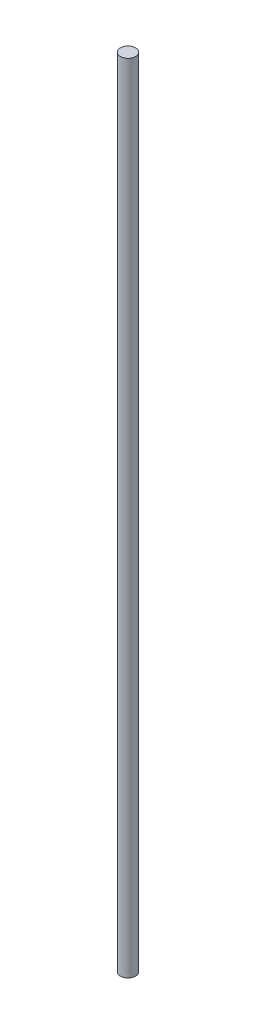
ISO-10303-21;
HEADER;
FILE_DESCRIPTION(('STEP AP214'),'2;1');
FILE_NAME('part.step','',(''),(''),'','','');
FILE_SCHEMA(('AUTOMOTIVE_DESIGN { 1 0 10303 214 1 1 1 1 }'));
ENDSEC;
DATA;
#1=APPLICATION_CONTEXT('core data for automotive mechanical design processes');
#2=APPLICATION_PROTOCOL_DEFINITION('international standard','automotive_design',2000,#1);
#3=PRODUCT_CONTEXT('',#1,'mechanical');
#4=PRODUCT('Part','Part','',(#3));
#5=PRODUCT_RELATED_PRODUCT_CATEGORY('part','',(#4));
#6=PRODUCT_DEFINITION_FORMATION('','',#4);
#7=PRODUCT_DEFINITION_CONTEXT('part definition',#1,'design');
#8=PRODUCT_DEFINITION('design','',#6,#7);
#9=PRODUCT_DEFINITION_SHAPE('','',#8);
#10=(LENGTH_UNIT() NAMED_UNIT(*) SI_UNIT(.MILLI.,.METRE.));
#11=(NAMED_UNIT(*) PLANE_ANGLE_UNIT() SI_UNIT($,.RADIAN.));
#12=(NAMED_UNIT(*) SI_UNIT($,.STERADIAN.) SOLID_ANGLE_UNIT());
#13=UNCERTAINTY_MEASURE_WITH_UNIT(LENGTH_MEASURE(1.E-05),#10,'distance_accuracy_value','');
#14=(GEOMETRIC_REPRESENTATION_CONTEXT(3) GLOBAL_UNCERTAINTY_ASSIGNED_CONTEXT((#13)) GLOBAL_UNIT_ASSIGNED_CONTEXT((#10,
#11,#12)) REPRESENTATION_CONTEXT('',''));
#15=CARTESIAN_POINT('',(0.,0.,0.));
#16=DIRECTION('',(0.,0.,1.));
#17=DIRECTION('',(1.,0.,0.));
#18=AXIS2_PLACEMENT_3D('',#15,#16,#17);
#19=CARTESIAN_POINT('',(0.,210.,0.));
#20=DIRECTION('',(0.,-1.,0.));
#21=DIRECTION('',(0.,0.,-1.));
#22=AXIS2_PLACEMENT_3D('',#19,#20,#21);
#23=CYLINDRICAL_SURFACE('',#22,2.);
#24=CARTESIAN_POINT('',(0.,210.,0.));
#25=DIRECTION('',(0.,1.,0.));
#26=DIRECTION('',(0.,0.,1.));
#27=AXIS2_PLACEMENT_3D('',#24,#25,#26);
#28=CIRCLE('',#27,2.);
#29=CARTESIAN_POINT('',(0.,210.,2.));
#30=VERTEX_POINT('',#29);
#31=EDGE_CURVE('E10',#30,#30,#28,.T.);
#32=ORIENTED_EDGE('',*,*,#31,.F.);
#33=EDGE_LOOP('',(#32));
#34=FACE_BOUND('',#33,.T.);
#35=CARTESIAN_POINT('',(0.,0.,0.));
#36=DIRECTION('',(0.,1.,0.));
#37=DIRECTION('',(0.,0.,1.));
#38=AXIS2_PLACEMENT_3D('',#35,#36,#37);
#39=CIRCLE('',#38,2.);
#40=CARTESIAN_POINT('',(0.,0.,2.));
#41=VERTEX_POINT('',#40);
#42=EDGE_CURVE('E40',#41,#41,#39,.T.);
#43=ORIENTED_EDGE('',*,*,#42,.T.);
#44=EDGE_LOOP('',(#43));
#45=FACE_BOUND('',#44,.T.);
#46=ADVANCED_FACE('F37',(#34,#45),#23,.T.);
#47=CARTESIAN_POINT('',(0.,210.,0.));
#48=DIRECTION('',(0.,1.,0.));
#49=DIRECTION('',(0.,0.,1.));
#50=AXIS2_PLACEMENT_3D('',#47,#48,#49);
#51=PLANE('',#50);
#52=ORIENTED_EDGE('',*,*,#31,.T.);
#53=EDGE_LOOP('',(#52));
#54=FACE_BOUND('',#53,.T.);
#55=ADVANCED_FACE('F52',(#54),#51,.T.);
#56=CARTESIAN_POINT('',(0.,0.,0.));
#57=DIRECTION('',(0.,1.,0.));
#58=DIRECTION('',(0.,0.,1.));
#59=AXIS2_PLACEMENT_3D('',#56,#57,#58);
#60=PLANE('',#59);
#61=ORIENTED_EDGE('',*,*,#42,.F.);
#62=EDGE_LOOP('',(#61));
#63=FACE_BOUND('',#62,.T.);
#64=ADVANCED_FACE('F50',(#63),#60,.F.);
#65=CLOSED_SHELL('',(#46,#55,#64));
#66=MANIFOLD_SOLID_BREP('B2',#65);
#67=ADVANCED_BREP_SHAPE_REPRESENTATION('',(#18,#66),#14);
#68=SHAPE_DEFINITION_REPRESENTATION(#9,#67);
ENDSEC;
END-ISO-10303-21;
